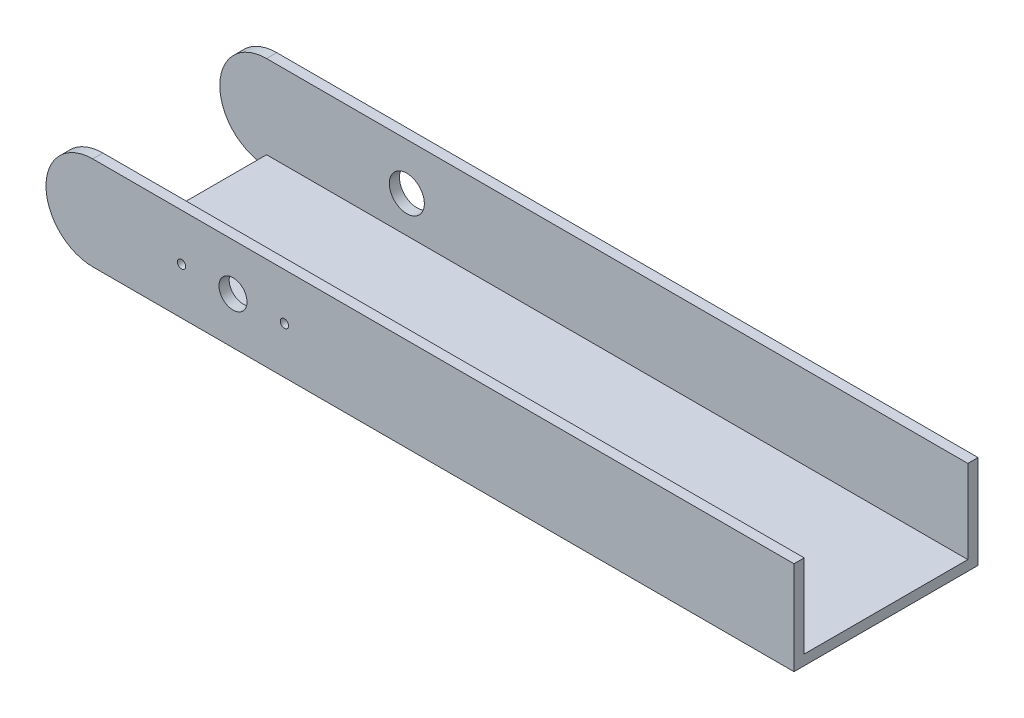
ISO-10303-21;
HEADER;
FILE_DESCRIPTION(('STEP AP214'),'2;1');
FILE_NAME('part.step','',(''),(''),'','','');
FILE_SCHEMA(('AUTOMOTIVE_DESIGN { 1 0 10303 214 1 1 1 1 }'));
ENDSEC;
DATA;
#1=APPLICATION_CONTEXT('core data for automotive mechanical design processes');
#2=APPLICATION_PROTOCOL_DEFINITION('international standard','automotive_design',2000,#1);
#3=PRODUCT_CONTEXT('',#1,'mechanical');
#4=PRODUCT('Part','Part','',(#3));
#5=PRODUCT_RELATED_PRODUCT_CATEGORY('part','',(#4));
#6=PRODUCT_DEFINITION_FORMATION('','',#4);
#7=PRODUCT_DEFINITION_CONTEXT('part definition',#1,'design');
#8=PRODUCT_DEFINITION('design','',#6,#7);
#9=PRODUCT_DEFINITION_SHAPE('','',#8);
#10=(LENGTH_UNIT() NAMED_UNIT(*) SI_UNIT(.MILLI.,.METRE.));
#11=(NAMED_UNIT(*) PLANE_ANGLE_UNIT() SI_UNIT($,.RADIAN.));
#12=(NAMED_UNIT(*) SI_UNIT($,.STERADIAN.) SOLID_ANGLE_UNIT());
#13=UNCERTAINTY_MEASURE_WITH_UNIT(LENGTH_MEASURE(1.E-05),#10,'distance_accuracy_value','');
#14=(GEOMETRIC_REPRESENTATION_CONTEXT(3) GLOBAL_UNCERTAINTY_ASSIGNED_CONTEXT((#13)) GLOBAL_UNIT_ASSIGNED_CONTEXT((#10,
#11,#12)) REPRESENTATION_CONTEXT('',''));
#15=CARTESIAN_POINT('',(0.,0.,0.));
#16=DIRECTION('',(0.,0.,1.));
#17=DIRECTION('',(1.,0.,0.));
#18=AXIS2_PLACEMENT_3D('',#15,#16,#17);
#19=CARTESIAN_POINT('',(-2.23406487753398E-06,12.7,2.7686));
#20=DIRECTION('',(0.,0.,-1.));
#21=DIRECTION('',(-1.,0.,0.));
#22=AXIS2_PLACEMENT_3D('',#19,#20,#21);
#23=CYLINDRICAL_SURFACE('',#22,12.7000000000002);
#24=CARTESIAN_POINT('',(-2.23406487753398E-06,12.7,0.));
#25=DIRECTION('',(0.,0.,1.));
#26=DIRECTION('',(1.,0.,0.));
#27=AXIS2_PLACEMENT_3D('',#24,#25,#26);
#28=CIRCLE('',#27,12.7000000000002);
#29=CARTESIAN_POINT('',(-4.46812975506797E-06,25.4,0.));
#30=VERTEX_POINT('',#29);
#31=CARTESIAN_POINT('',(0.,0.,0.));
#32=VERTEX_POINT('',#31);
#33=EDGE_CURVE('E188',#30,#32,#28,.T.);
#34=ORIENTED_EDGE('',*,*,#33,.T.);
#35=DIRECTION('',(0.,0.,-1.));
#36=VECTOR('',#35,1.);
#37=CARTESIAN_POINT('',(0.,0.,2.7686));
#38=LINE('',#37,#36);
#39=CARTESIAN_POINT('',(0.,0.,2.7686));
#40=VERTEX_POINT('',#39);
#41=EDGE_CURVE('E11',#40,#32,#38,.T.);
#42=ORIENTED_EDGE('',*,*,#41,.F.);
#43=CARTESIAN_POINT('',(-2.23406487753398E-06,12.7,2.7686));
#44=DIRECTION('',(0.,0.,1.));
#45=DIRECTION('',(1.,0.,0.));
#46=AXIS2_PLACEMENT_3D('',#43,#44,#45);
#47=CIRCLE('',#46,12.7000000000002);
#48=CARTESIAN_POINT('',(-4.46812975506797E-06,25.4,2.7686));
#49=VERTEX_POINT('',#48);
#50=EDGE_CURVE('E191',#49,#40,#47,.T.);
#51=ORIENTED_EDGE('',*,*,#50,.F.);
#52=DIRECTION('',(0.,0.,-1.));
#53=VECTOR('',#52,1.);
#54=CARTESIAN_POINT('',(-4.46812975506797E-06,25.4,2.7686));
#55=LINE('',#54,#53);
#56=EDGE_CURVE('E196',#49,#30,#55,.T.);
#57=ORIENTED_EDGE('',*,*,#56,.T.);
#58=EDGE_LOOP('',(#34,#42,#51,#57));
#59=FACE_BOUND('',#58,.T.);
#60=ADVANCED_FACE('F35',(#59),#23,.T.);
#61=CARTESIAN_POINT('',(0.,0.,2.7686));
#62=DIRECTION('',(0.,1.,0.));
#63=DIRECTION('',(0.,0.,1.));
#64=AXIS2_PLACEMENT_3D('',#61,#62,#63);
#65=PLANE('',#64);
#66=ORIENTED_EDGE('',*,*,#41,.T.);
#67=DIRECTION('',(0.,0.,1.));
#68=VECTOR('',#67,1.);
#69=CARTESIAN_POINT('',(-2.2340646832486E-06,0.,-44.45));
#70=LINE('',#69,#68);
#71=CARTESIAN_POINT('',(-2.2340646832486E-06,0.,-44.45));
#72=VERTEX_POINT('',#71);
#73=EDGE_CURVE('E170',#72,#32,#70,.T.);
#74=ORIENTED_EDGE('',*,*,#73,.F.);
#75=DIRECTION('',(0.,0.,1.));
#76=VECTOR('',#75,1.);
#77=CARTESIAN_POINT('',(0.,0.,-47.2186));
#78=LINE('',#77,#76);
#79=CARTESIAN_POINT('',(0.,0.,-47.2186));
#80=VERTEX_POINT('',#79);
#81=EDGE_CURVE('E132',#80,#72,#78,.T.);
#82=ORIENTED_EDGE('',*,*,#81,.F.);
#83=DIRECTION('',(-1.,0.,0.));
#84=VECTOR('',#83,1.);
#85=CARTESIAN_POINT('',(190.499997765935,0.,-47.2186));
#86=LINE('',#85,#84);
#87=CARTESIAN_POINT('',(190.499997765935,0.,-47.2186));
#88=VERTEX_POINT('',#87);
#89=EDGE_CURVE('E122',#88,#80,#86,.T.);
#90=ORIENTED_EDGE('',*,*,#89,.F.);
#91=DIRECTION('',(0.,0.,-1.));
#92=VECTOR('',#91,1.);
#93=CARTESIAN_POINT('',(190.499997765935,0.,2.7686));
#94=LINE('',#93,#92);
#95=CARTESIAN_POINT('',(190.499997765935,0.,2.7686));
#96=VERTEX_POINT('',#95);
#97=EDGE_CURVE('E43',#96,#88,#94,.T.);
#98=ORIENTED_EDGE('',*,*,#97,.F.);
#99=DIRECTION('',(1.,0.,0.));
#100=VECTOR('',#99,1.);
#101=CARTESIAN_POINT('',(0.,0.,2.7686));
#102=LINE('',#101,#100);
#103=EDGE_CURVE('E79',#40,#96,#102,.T.);
#104=ORIENTED_EDGE('',*,*,#103,.F.);
#105=EDGE_LOOP('',(#66,#74,#82,#90,#98,#104));
#106=FACE_BOUND('',#105,.T.);
#107=ADVANCED_FACE('F129',(#106),#65,.F.);
#108=CARTESIAN_POINT('',(190.499997765935,0.,2.7686));
#109=DIRECTION('',(-1.,0.,0.));
#110=DIRECTION('',(0.,0.,1.));
#111=AXIS2_PLACEMENT_3D('',#108,#109,#110);
#112=PLANE('',#111);
#113=ORIENTED_EDGE('',*,*,#97,.T.);
#114=DIRECTION('',(0.,-1.,0.));
#115=VECTOR('',#114,1.);
#116=CARTESIAN_POINT('',(190.499997765935,12.7,-47.2186));
#117=LINE('',#116,#115);
#118=CARTESIAN_POINT('',(190.499997765935,25.4,-47.2186));
#119=VERTEX_POINT('',#118);
#120=EDGE_CURVE('E116',#119,#88,#117,.T.);
#121=ORIENTED_EDGE('',*,*,#120,.F.);
#122=DIRECTION('',(0.,0.,1.));
#123=VECTOR('',#122,1.);
#124=CARTESIAN_POINT('',(190.499997765935,25.4,-47.2186));
#125=LINE('',#124,#123);
#126=CARTESIAN_POINT('',(190.499997765935,25.4,-44.45));
#127=VERTEX_POINT('',#126);
#128=EDGE_CURVE('E140',#119,#127,#125,.T.);
#129=ORIENTED_EDGE('',*,*,#128,.T.);
#130=DIRECTION('',(0.,-1.,0.));
#131=VECTOR('',#130,1.);
#132=CARTESIAN_POINT('',(190.499997765935,12.7,-44.45));
#133=LINE('',#132,#131);
#134=CARTESIAN_POINT('',(190.499997765935,2.7686,-44.45));
#135=VERTEX_POINT('',#134);
#136=EDGE_CURVE('E141',#127,#135,#133,.T.);
#137=ORIENTED_EDGE('',*,*,#136,.T.);
#138=DIRECTION('',(0.,0.,1.));
#139=VECTOR('',#138,1.);
#140=CARTESIAN_POINT('',(190.499997765935,2.7686,-44.45));
#141=LINE('',#140,#139);
#142=CARTESIAN_POINT('',(190.499997765935,2.7686,0.));
#143=VERTEX_POINT('',#142);
#144=EDGE_CURVE('E167',#135,#143,#141,.T.);
#145=ORIENTED_EDGE('',*,*,#144,.T.);
#146=DIRECTION('',(0.,1.,0.));
#147=VECTOR('',#146,1.);
#148=CARTESIAN_POINT('',(190.499997765935,0.,0.));
#149=LINE('',#148,#147);
#150=CARTESIAN_POINT('',(190.499997765935,25.4,0.));
#151=VERTEX_POINT('',#150);
#152=EDGE_CURVE('E66',#143,#151,#149,.T.);
#153=ORIENTED_EDGE('',*,*,#152,.T.);
#154=DIRECTION('',(0.,0.,-1.));
#155=VECTOR('',#154,1.);
#156=CARTESIAN_POINT('',(190.499997765935,25.4,2.7686));
#157=LINE('',#156,#155);
#158=CARTESIAN_POINT('',(190.499997765935,25.4,2.7686));
#159=VERTEX_POINT('',#158);
#160=EDGE_CURVE('E119',#159,#151,#157,.T.);
#161=ORIENTED_EDGE('',*,*,#160,.F.);
#162=DIRECTION('',(0.,1.,0.));
#163=VECTOR('',#162,1.);
#164=CARTESIAN_POINT('',(190.499997765935,0.,2.7686));
#165=LINE('',#164,#163);
#166=EDGE_CURVE('E117',#96,#159,#165,.T.);
#167=ORIENTED_EDGE('',*,*,#166,.F.);
#168=EDGE_LOOP('',(#113,#121,#129,#137,#145,#153,#161,#167));
#169=FACE_BOUND('',#168,.T.);
#170=ADVANCED_FACE('F114',(#169),#112,.F.);
#171=CARTESIAN_POINT('',(-4.46812975506797E-06,25.4,2.7686));
#172=DIRECTION('',(0.,-1.,0.));
#173=DIRECTION('',(0.,0.,-1.));
#174=AXIS2_PLACEMENT_3D('',#171,#172,#173);
#175=PLANE('',#174);
#176=DIRECTION('',(-1.,0.,0.));
#177=VECTOR('',#176,1.);
#178=CARTESIAN_POINT('',(-4.46812975506797E-06,25.4,0.));
#179=LINE('',#178,#177);
#180=EDGE_CURVE('E72',#151,#30,#179,.T.);
#181=ORIENTED_EDGE('',*,*,#180,.T.);
#182=ORIENTED_EDGE('',*,*,#56,.F.);
#183=DIRECTION('',(-1.,0.,0.));
#184=VECTOR('',#183,1.);
#185=CARTESIAN_POINT('',(-4.46812975506797E-06,25.4,2.7686));
#186=LINE('',#185,#184);
#187=EDGE_CURVE('E51',#159,#49,#186,.T.);
#188=ORIENTED_EDGE('',*,*,#187,.F.);
#189=ORIENTED_EDGE('',*,*,#160,.T.);
#190=EDGE_LOOP('',(#181,#182,#188,#189));
#191=FACE_BOUND('',#190,.T.);
#192=ADVANCED_FACE('F202',(#191),#175,.F.);
#193=CARTESIAN_POINT('',(-2.23406487753398E-06,12.7,2.7686));
#194=DIRECTION('',(0.,0.,1.));
#195=DIRECTION('',(1.,0.,0.));
#196=AXIS2_PLACEMENT_3D('',#193,#194,#195);
#197=PLANE('',#196);
#198=CARTESIAN_POINT('',(24.1299977659349,12.7,2.7686));
#199=DIRECTION('',(0.,0.,1.));
#200=DIRECTION('',(1.,0.,0.));
#201=AXIS2_PLACEMENT_3D('',#198,#199,#200);
#202=CIRCLE('',#201,1.1303);
#203=CARTESIAN_POINT('',(25.2602977659349,12.7,2.7686));
#204=VERTEX_POINT('',#203);
#205=EDGE_CURVE('E169',#204,#204,#202,.T.);
#206=ORIENTED_EDGE('',*,*,#205,.F.);
#207=EDGE_LOOP('',(#206));
#208=FACE_BOUND('',#207,.T.);
#209=CARTESIAN_POINT('',(52.0699977659349,12.7,2.7686));
#210=DIRECTION('',(0.,0.,1.));
#211=DIRECTION('',(1.,0.,0.));
#212=AXIS2_PLACEMENT_3D('',#209,#210,#211);
#213=CIRCLE('',#212,1.1303);
#214=CARTESIAN_POINT('',(53.2002977659349,12.7,2.7686));
#215=VERTEX_POINT('',#214);
#216=EDGE_CURVE('E177',#215,#215,#213,.T.);
#217=ORIENTED_EDGE('',*,*,#216,.F.);
#218=EDGE_LOOP('',(#217));
#219=FACE_BOUND('',#218,.T.);
#220=CARTESIAN_POINT('',(38.0999977659349,12.7,2.7686));
#221=DIRECTION('',(0.,0.,1.));
#222=DIRECTION('',(1.,0.,0.));
#223=AXIS2_PLACEMENT_3D('',#220,#221,#222);
#224=CIRCLE('',#223,3.81);
#225=CARTESIAN_POINT('',(41.9099977659349,12.7,2.7686));
#226=VERTEX_POINT('',#225);
#227=EDGE_CURVE('E176',#226,#226,#224,.T.);
#228=ORIENTED_EDGE('',*,*,#227,.F.);
#229=EDGE_LOOP('',(#228));
#230=FACE_BOUND('',#229,.T.);
#231=ORIENTED_EDGE('',*,*,#50,.T.);
#232=ORIENTED_EDGE('',*,*,#103,.T.);
#233=ORIENTED_EDGE('',*,*,#166,.T.);
#234=ORIENTED_EDGE('',*,*,#187,.T.);
#235=EDGE_LOOP('',(#231,#232,#233,#234));
#236=FACE_BOUND('',#235,.T.);
#237=ADVANCED_FACE('F210',(#208,#219,#230,#236),#197,.T.);
#238=CARTESIAN_POINT('',(-2.23406487753398E-06,12.7,0.));
#239=DIRECTION('',(0.,0.,1.));
#240=DIRECTION('',(1.,0.,0.));
#241=AXIS2_PLACEMENT_3D('',#238,#239,#240);
#242=PLANE('',#241);
#243=CARTESIAN_POINT('',(24.1299977659349,12.7,0.));
#244=DIRECTION('',(0.,0.,1.));
#245=DIRECTION('',(1.,0.,0.));
#246=AXIS2_PLACEMENT_3D('',#243,#244,#245);
#247=CIRCLE('',#246,1.1303);
#248=CARTESIAN_POINT('',(25.2602977659349,12.7,0.));
#249=VERTEX_POINT('',#248);
#250=EDGE_CURVE('E180',#249,#249,#247,.T.);
#251=ORIENTED_EDGE('',*,*,#250,.T.);
#252=EDGE_LOOP('',(#251));
#253=FACE_BOUND('',#252,.T.);
#254=CARTESIAN_POINT('',(52.0699977659349,12.7,0.));
#255=DIRECTION('',(0.,0.,1.));
#256=DIRECTION('',(1.,0.,0.));
#257=AXIS2_PLACEMENT_3D('',#254,#255,#256);
#258=CIRCLE('',#257,1.1303);
#259=CARTESIAN_POINT('',(53.2002977659349,12.7,0.));
#260=VERTEX_POINT('',#259);
#261=EDGE_CURVE('E173',#260,#260,#258,.T.);
#262=ORIENTED_EDGE('',*,*,#261,.T.);
#263=EDGE_LOOP('',(#262));
#264=FACE_BOUND('',#263,.T.);
#265=CARTESIAN_POINT('',(38.0999977659349,12.7,0.));
#266=DIRECTION('',(0.,0.,1.));
#267=DIRECTION('',(1.,0.,0.));
#268=AXIS2_PLACEMENT_3D('',#265,#266,#267);
#269=CIRCLE('',#268,3.81);
#270=CARTESIAN_POINT('',(41.9099977659349,12.7,0.));
#271=VERTEX_POINT('',#270);
#272=EDGE_CURVE('E185',#271,#271,#269,.T.);
#273=ORIENTED_EDGE('',*,*,#272,.T.);
#274=EDGE_LOOP('',(#273));
#275=FACE_BOUND('',#274,.T.);
#276=ORIENTED_EDGE('',*,*,#152,.F.);
#277=DIRECTION('',(-1.,0.,0.));
#278=VECTOR('',#277,1.);
#279=CARTESIAN_POINT('',(-2.23406487753398E-06,2.7686,0.));
#280=LINE('',#279,#278);
#281=CARTESIAN_POINT('',(-2.2340646832486E-06,2.7686,0.));
#282=VERTEX_POINT('',#281);
#283=EDGE_CURVE('E154',#143,#282,#280,.T.);
#284=ORIENTED_EDGE('',*,*,#283,.T.);
#285=DIRECTION('',(0.,-1.,0.));
#286=VECTOR('',#285,1.);
#287=CARTESIAN_POINT('',(-2.2340646832486E-06,12.7,0.));
#288=LINE('',#287,#286);
#289=EDGE_CURVE('E159',#282,#32,#288,.T.);
#290=ORIENTED_EDGE('',*,*,#289,.T.);
#291=ORIENTED_EDGE('',*,*,#33,.F.);
#292=ORIENTED_EDGE('',*,*,#180,.F.);
#293=EDGE_LOOP('',(#276,#284,#290,#291,#292));
#294=FACE_BOUND('',#293,.T.);
#295=ADVANCED_FACE('F205',(#253,#264,#275,#294),#242,.F.);
#296=CARTESIAN_POINT('',(38.0999977659349,12.7,0.));
#297=DIRECTION('',(0.,0.,1.));
#298=DIRECTION('',(1.,0.,0.));
#299=AXIS2_PLACEMENT_3D('',#296,#297,#298);
#300=CYLINDRICAL_SURFACE('',#299,3.81);
#301=ORIENTED_EDGE('',*,*,#272,.F.);
#302=EDGE_LOOP('',(#301));
#303=FACE_BOUND('',#302,.T.);
#304=ORIENTED_EDGE('',*,*,#227,.T.);
#305=EDGE_LOOP('',(#304));
#306=FACE_BOUND('',#305,.T.);
#307=ADVANCED_FACE('F218',(#303,#306),#300,.F.);
#308=CARTESIAN_POINT('',(52.0699977659349,12.7,0.));
#309=DIRECTION('',(0.,0.,1.));
#310=DIRECTION('',(1.,0.,0.));
#311=AXIS2_PLACEMENT_3D('',#308,#309,#310);
#312=CYLINDRICAL_SURFACE('',#311,1.1303);
#313=ORIENTED_EDGE('',*,*,#261,.F.);
#314=EDGE_LOOP('',(#313));
#315=FACE_BOUND('',#314,.T.);
#316=ORIENTED_EDGE('',*,*,#216,.T.);
#317=EDGE_LOOP('',(#316));
#318=FACE_BOUND('',#317,.T.);
#319=ADVANCED_FACE('F255',(#315,#318),#312,.F.);
#320=CARTESIAN_POINT('',(24.1299977659349,12.7,0.));
#321=DIRECTION('',(0.,0.,1.));
#322=DIRECTION('',(1.,0.,0.));
#323=AXIS2_PLACEMENT_3D('',#320,#321,#322);
#324=CYLINDRICAL_SURFACE('',#323,1.1303);
#325=ORIENTED_EDGE('',*,*,#250,.F.);
#326=EDGE_LOOP('',(#325));
#327=FACE_BOUND('',#326,.T.);
#328=ORIENTED_EDGE('',*,*,#205,.T.);
#329=EDGE_LOOP('',(#328));
#330=FACE_BOUND('',#329,.T.);
#331=ADVANCED_FACE('F264',(#327,#330),#324,.F.);
#332=CARTESIAN_POINT('',(-2.23406487753398E-06,2.7686,-44.45));
#333=DIRECTION('',(0.,1.,0.));
#334=DIRECTION('',(0.,0.,1.));
#335=AXIS2_PLACEMENT_3D('',#332,#333,#334);
#336=PLANE('',#335);
#337=ORIENTED_EDGE('',*,*,#283,.F.);
#338=ORIENTED_EDGE('',*,*,#144,.F.);
#339=DIRECTION('',(-1.,0.,0.));
#340=VECTOR('',#339,1.);
#341=CARTESIAN_POINT('',(-2.23406487753398E-06,2.7686,-44.45));
#342=LINE('',#341,#340);
#343=CARTESIAN_POINT('',(-2.2340646832486E-06,2.7686,-44.45));
#344=VERTEX_POINT('',#343);
#345=EDGE_CURVE('E155',#135,#344,#342,.T.);
#346=ORIENTED_EDGE('',*,*,#345,.T.);
#347=DIRECTION('',(0.,0.,1.));
#348=VECTOR('',#347,1.);
#349=CARTESIAN_POINT('',(-2.2340646832486E-06,2.7686,-44.45));
#350=LINE('',#349,#348);
#351=EDGE_CURVE('E162',#344,#282,#350,.T.);
#352=ORIENTED_EDGE('',*,*,#351,.T.);
#353=EDGE_LOOP('',(#337,#338,#346,#352));
#354=FACE_BOUND('',#353,.T.);
#355=ADVANCED_FACE('F273',(#354),#336,.T.);
#356=CARTESIAN_POINT('',(-2.2340646832486E-06,12.7,-44.45));
#357=DIRECTION('',(-1.,0.,0.));
#358=DIRECTION('',(0.,0.,1.));
#359=AXIS2_PLACEMENT_3D('',#356,#357,#358);
#360=PLANE('',#359);
#361=ORIENTED_EDGE('',*,*,#289,.F.);
#362=ORIENTED_EDGE('',*,*,#351,.F.);
#363=DIRECTION('',(0.,-1.,0.));
#364=VECTOR('',#363,1.);
#365=CARTESIAN_POINT('',(-2.2340646832486E-06,12.7,-44.45));
#366=LINE('',#365,#364);
#367=EDGE_CURVE('E158',#344,#72,#366,.T.);
#368=ORIENTED_EDGE('',*,*,#367,.T.);
#369=ORIENTED_EDGE('',*,*,#73,.T.);
#370=EDGE_LOOP('',(#361,#362,#368,#369));
#371=FACE_BOUND('',#370,.T.);
#372=ADVANCED_FACE('F300',(#371),#360,.T.);
#373=CARTESIAN_POINT('',(-2.23406487753398E-06,12.7,-44.45));
#374=DIRECTION('',(0.,0.,1.));
#375=DIRECTION('',(1.,0.,0.));
#376=AXIS2_PLACEMENT_3D('',#373,#374,#375);
#377=PLANE('',#376);
#378=CARTESIAN_POINT('',(38.0999977659349,12.7,-44.45));
#379=DIRECTION('',(0.,0.,1.));
#380=DIRECTION('',(1.,0.,0.));
#381=AXIS2_PLACEMENT_3D('',#378,#379,#380);
#382=CIRCLE('',#381,4.7625);
#383=CARTESIAN_POINT('',(42.8624977659349,12.7,-44.45));
#384=VERTEX_POINT('',#383);
#385=EDGE_CURVE('E145',#384,#384,#382,.T.);
#386=ORIENTED_EDGE('',*,*,#385,.F.);
#387=EDGE_LOOP('',(#386));
#388=FACE_BOUND('',#387,.T.);
#389=ORIENTED_EDGE('',*,*,#345,.F.);
#390=ORIENTED_EDGE('',*,*,#136,.F.);
#391=DIRECTION('',(1.,0.,0.));
#392=VECTOR('',#391,1.);
#393=CARTESIAN_POINT('',(-4.46812975506797E-06,25.4,-44.45));
#394=LINE('',#393,#392);
#395=CARTESIAN_POINT('',(-4.46812975506797E-06,25.4,-44.45));
#396=VERTEX_POINT('',#395);
#397=EDGE_CURVE('E127',#396,#127,#394,.T.);
#398=ORIENTED_EDGE('',*,*,#397,.F.);
#399=CARTESIAN_POINT('',(-2.23406487753398E-06,12.7,-44.45));
#400=DIRECTION('',(0.,0.,-1.));
#401=DIRECTION('',(1.,0.,0.));
#402=AXIS2_PLACEMENT_3D('',#399,#400,#401);
#403=CIRCLE('',#402,12.7000000000002);
#404=EDGE_CURVE('E144',#72,#396,#403,.T.);
#405=ORIENTED_EDGE('',*,*,#404,.F.);
#406=ORIENTED_EDGE('',*,*,#367,.F.);
#407=EDGE_LOOP('',(#389,#390,#398,#405,#406));
#408=FACE_BOUND('',#407,.T.);
#409=ADVANCED_FACE('F312',(#388,#408),#377,.T.);
#410=CARTESIAN_POINT('',(-2.23406487753398E-06,12.7,-47.2186));
#411=DIRECTION('',(0.,0.,1.));
#412=DIRECTION('',(1.,0.,0.));
#413=AXIS2_PLACEMENT_3D('',#410,#411,#412);
#414=CYLINDRICAL_SURFACE('',#413,12.7000000000002);
#415=ORIENTED_EDGE('',*,*,#404,.T.);
#416=DIRECTION('',(0.,0.,1.));
#417=VECTOR('',#416,1.);
#418=CARTESIAN_POINT('',(-4.46812975506797E-06,25.4,-47.2186));
#419=LINE('',#418,#417);
#420=CARTESIAN_POINT('',(-4.46812975506797E-06,25.4,-47.2186));
#421=VERTEX_POINT('',#420);
#422=EDGE_CURVE('E150',#421,#396,#419,.T.);
#423=ORIENTED_EDGE('',*,*,#422,.F.);
#424=CARTESIAN_POINT('',(-2.23406487753398E-06,12.7,-47.2186));
#425=DIRECTION('',(0.,0.,-1.));
#426=DIRECTION('',(1.,0.,0.));
#427=AXIS2_PLACEMENT_3D('',#424,#425,#426);
#428=CIRCLE('',#427,12.7000000000002);
#429=EDGE_CURVE('E134',#80,#421,#428,.T.);
#430=ORIENTED_EDGE('',*,*,#429,.F.);
#431=ORIENTED_EDGE('',*,*,#81,.T.);
#432=EDGE_LOOP('',(#415,#423,#430,#431));
#433=FACE_BOUND('',#432,.T.);
#434=ADVANCED_FACE('F318',(#433),#414,.T.);
#435=CARTESIAN_POINT('',(-4.46812975506797E-06,25.4,-47.2186));
#436=DIRECTION('',(0.,-1.,0.));
#437=DIRECTION('',(0.,0.,-1.));
#438=AXIS2_PLACEMENT_3D('',#435,#436,#437);
#439=PLANE('',#438);
#440=ORIENTED_EDGE('',*,*,#397,.T.);
#441=ORIENTED_EDGE('',*,*,#128,.F.);
#442=DIRECTION('',(1.,0.,0.));
#443=VECTOR('',#442,1.);
#444=CARTESIAN_POINT('',(-4.46812975506797E-06,25.4,-47.2186));
#445=LINE('',#444,#443);
#446=EDGE_CURVE('E125',#421,#119,#445,.T.);
#447=ORIENTED_EDGE('',*,*,#446,.F.);
#448=ORIENTED_EDGE('',*,*,#422,.T.);
#449=EDGE_LOOP('',(#440,#441,#447,#448));
#450=FACE_BOUND('',#449,.T.);
#451=ADVANCED_FACE('F329',(#450),#439,.F.);
#452=CARTESIAN_POINT('',(-2.23406487753398E-06,12.7,-47.2186));
#453=DIRECTION('',(0.,0.,1.));
#454=DIRECTION('',(1.,0.,0.));
#455=AXIS2_PLACEMENT_3D('',#452,#453,#454);
#456=PLANE('',#455);
#457=CARTESIAN_POINT('',(38.0999977659349,12.7,-47.2186));
#458=DIRECTION('',(0.,0.,1.));
#459=DIRECTION('',(1.,0.,0.));
#460=AXIS2_PLACEMENT_3D('',#457,#458,#459);
#461=CIRCLE('',#460,4.7625);
#462=CARTESIAN_POINT('',(42.8624977659349,12.7,-47.2186));
#463=VERTEX_POINT('',#462);
#464=EDGE_CURVE('E380',#463,#463,#461,.T.);
#465=ORIENTED_EDGE('',*,*,#464,.T.);
#466=EDGE_LOOP('',(#465));
#467=FACE_BOUND('',#466,.T.);
#468=ORIENTED_EDGE('',*,*,#120,.T.);
#469=ORIENTED_EDGE('',*,*,#89,.T.);
#470=ORIENTED_EDGE('',*,*,#429,.T.);
#471=ORIENTED_EDGE('',*,*,#446,.T.);
#472=EDGE_LOOP('',(#468,#469,#470,#471));
#473=FACE_BOUND('',#472,.T.);
#474=ADVANCED_FACE('F121',(#467,#473),#456,.F.);
#475=CARTESIAN_POINT('',(38.0999977659349,12.7,-30.9796158183963));
#476=DIRECTION('',(0.,0.,-1.));
#477=DIRECTION('',(-1.,0.,0.));
#478=AXIS2_PLACEMENT_3D('',#475,#476,#477);
#479=CYLINDRICAL_SURFACE('',#478,4.7625);
#480=ORIENTED_EDGE('',*,*,#464,.F.);
#481=EDGE_LOOP('',(#480));
#482=FACE_BOUND('',#481,.T.);
#483=ORIENTED_EDGE('',*,*,#385,.T.);
#484=EDGE_LOOP('',(#483));
#485=FACE_BOUND('',#484,.T.);
#486=ADVANCED_FACE('F344',(#482,#485),#479,.F.);
#487=CLOSED_SHELL('',(#60,#107,#170,#192,#237,#295,#307,#319,#331,#355,#372,#409,#434,#451,#474,#486));
#488=MANIFOLD_SOLID_BREP('B2',#487);
#489=ADVANCED_BREP_SHAPE_REPRESENTATION('',(#18,#488),#14);
#490=SHAPE_DEFINITION_REPRESENTATION(#9,#489);
ENDSEC;
END-ISO-10303-21;
